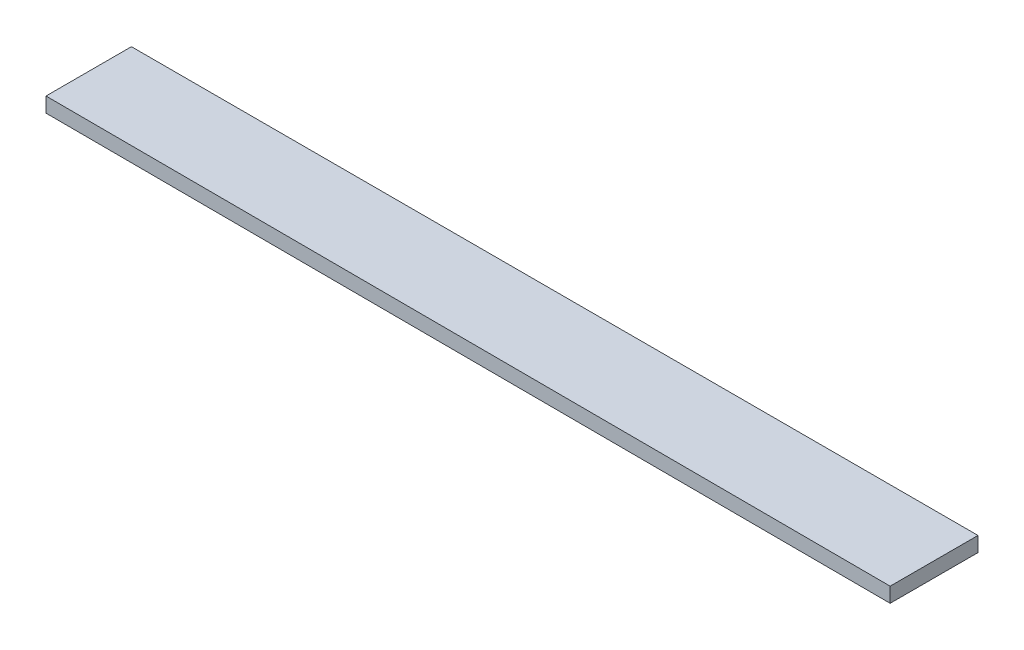
ISO-10303-21;
HEADER;
FILE_DESCRIPTION(('STEP AP214'),'2;1');
FILE_NAME('part.step','',(''),(''),'','','');
FILE_SCHEMA(('AUTOMOTIVE_DESIGN { 1 0 10303 214 1 1 1 1 }'));
ENDSEC;
DATA;
#1=APPLICATION_CONTEXT('core data for automotive mechanical design processes');
#2=APPLICATION_PROTOCOL_DEFINITION('international standard','automotive_design',2000,#1);
#3=PRODUCT_CONTEXT('',#1,'mechanical');
#4=PRODUCT('Part','Part','',(#3));
#5=PRODUCT_RELATED_PRODUCT_CATEGORY('part','',(#4));
#6=PRODUCT_DEFINITION_FORMATION('','',#4);
#7=PRODUCT_DEFINITION_CONTEXT('part definition',#1,'design');
#8=PRODUCT_DEFINITION('design','',#6,#7);
#9=PRODUCT_DEFINITION_SHAPE('','',#8);
#10=(LENGTH_UNIT() NAMED_UNIT(*) SI_UNIT(.MILLI.,.METRE.));
#11=(NAMED_UNIT(*) PLANE_ANGLE_UNIT() SI_UNIT($,.RADIAN.));
#12=(NAMED_UNIT(*) SI_UNIT($,.STERADIAN.) SOLID_ANGLE_UNIT());
#13=UNCERTAINTY_MEASURE_WITH_UNIT(LENGTH_MEASURE(1.E-05),#10,'distance_accuracy_value','');
#14=(GEOMETRIC_REPRESENTATION_CONTEXT(3) GLOBAL_UNCERTAINTY_ASSIGNED_CONTEXT((#13)) GLOBAL_UNIT_ASSIGNED_CONTEXT((#10,
#11,#12)) REPRESENTATION_CONTEXT('',''));
#15=CARTESIAN_POINT('',(0.,0.,0.));
#16=DIRECTION('',(0.,0.,1.));
#17=DIRECTION('',(1.,0.,0.));
#18=AXIS2_PLACEMENT_3D('',#15,#16,#17);
#19=CARTESIAN_POINT('',(0.,2.,0.));
#20=DIRECTION('',(0.00286274438782817,0.,-0.99999590233889));
#21=DIRECTION('',(-0.99999590233889,0.,-0.00286274438782817));
#22=AXIS2_PLACEMENT_3D('',#19,#20,#21);
#23=PLANE('',#22);
#24=DIRECTION('',(0.99999590233889,0.,0.00286274438782817));
#25=VECTOR('',#24,1.);
#26=CARTESIAN_POINT('',(0.,0.,0.));
#27=LINE('',#26,#25);
#28=CARTESIAN_POINT('',(0.,0.,0.));
#29=VERTEX_POINT('',#28);
#30=CARTESIAN_POINT('',(113.83622067277,0.,0.325885337230214));
#31=VERTEX_POINT('',#30);
#32=EDGE_CURVE('E107',#29,#31,#27,.T.);
#33=ORIENTED_EDGE('',*,*,#32,.T.);
#34=DIRECTION('',(0.,-1.,0.));
#35=VECTOR('',#34,1.);
#36=CARTESIAN_POINT('',(113.83622067277,2.,0.325885337230214));
#37=LINE('',#36,#35);
#38=CARTESIAN_POINT('',(113.83622067277,2.,0.325885337230214));
#39=VERTEX_POINT('',#38);
#40=EDGE_CURVE('E11',#39,#31,#37,.T.);
#41=ORIENTED_EDGE('',*,*,#40,.F.);
#42=DIRECTION('',(0.99999590233889,0.,0.00286274438782817));
#43=VECTOR('',#42,1.);
#44=CARTESIAN_POINT('',(0.,2.,0.));
#45=LINE('',#44,#43);
#46=CARTESIAN_POINT('',(0.,2.,0.));
#47=VERTEX_POINT('',#46);
#48=EDGE_CURVE('E91',#47,#39,#45,.T.);
#49=ORIENTED_EDGE('',*,*,#48,.F.);
#50=DIRECTION('',(0.,-1.,0.));
#51=VECTOR('',#50,1.);
#52=CARTESIAN_POINT('',(0.,2.,0.));
#53=LINE('',#52,#51);
#54=EDGE_CURVE('E103',#47,#29,#53,.T.);
#55=ORIENTED_EDGE('',*,*,#54,.T.);
#56=EDGE_LOOP('',(#33,#41,#49,#55));
#57=FACE_BOUND('',#56,.T.);
#58=ADVANCED_FACE('F39',(#57),#23,.F.);
#59=CARTESIAN_POINT('',(113.83622067277,2.,0.325885337230214));
#60=DIRECTION('',(-1.,0.,0.));
#61=DIRECTION('',(0.,0.,1.));
#62=AXIS2_PLACEMENT_3D('',#59,#60,#61);
#63=PLANE('',#62);
#64=DIRECTION('',(0.,0.,-1.));
#65=VECTOR('',#64,1.);
#66=CARTESIAN_POINT('',(113.83622067277,0.,0.325885337230214));
#67=LINE('',#66,#65);
#68=CARTESIAN_POINT('',(113.83622067277,0.,-11.4880548610417));
#69=VERTEX_POINT('',#68);
#70=EDGE_CURVE('E96',#31,#69,#67,.T.);
#71=ORIENTED_EDGE('',*,*,#70,.T.);
#72=DIRECTION('',(0.,-1.,0.));
#73=VECTOR('',#72,1.);
#74=CARTESIAN_POINT('',(113.83622067277,2.,-11.4880548610417));
#75=LINE('',#74,#73);
#76=CARTESIAN_POINT('',(113.83622067277,2.,-11.4880548610417));
#77=VERTEX_POINT('',#76);
#78=EDGE_CURVE('E48',#77,#69,#75,.T.);
#79=ORIENTED_EDGE('',*,*,#78,.F.);
#80=DIRECTION('',(0.,0.,-1.));
#81=VECTOR('',#80,1.);
#82=CARTESIAN_POINT('',(113.83622067277,2.,0.325885337230214));
#83=LINE('',#82,#81);
#84=EDGE_CURVE('E86',#39,#77,#83,.T.);
#85=ORIENTED_EDGE('',*,*,#84,.F.);
#86=ORIENTED_EDGE('',*,*,#40,.T.);
#87=EDGE_LOOP('',(#71,#79,#85,#86));
#88=FACE_BOUND('',#87,.T.);
#89=ADVANCED_FACE('F95',(#88),#63,.F.);
#90=CARTESIAN_POINT('',(113.83622067277,2.,-11.4880548610417));
#91=DIRECTION('',(0.,0.,1.));
#92=DIRECTION('',(1.,0.,0.));
#93=AXIS2_PLACEMENT_3D('',#90,#91,#92);
#94=PLANE('',#93);
#95=DIRECTION('',(-1.,0.,0.));
#96=VECTOR('',#95,1.);
#97=CARTESIAN_POINT('',(113.83622067277,0.,-11.4880548610417));
#98=LINE('',#97,#96);
#99=CARTESIAN_POINT('',(0.,0.,-11.4880548610417));
#100=VERTEX_POINT('',#99);
#101=EDGE_CURVE('E73',#69,#100,#98,.T.);
#102=ORIENTED_EDGE('',*,*,#101,.T.);
#103=DIRECTION('',(0.,-1.,0.));
#104=VECTOR('',#103,1.);
#105=CARTESIAN_POINT('',(0.,2.,-11.4880548610417));
#106=LINE('',#105,#104);
#107=CARTESIAN_POINT('',(0.,2.,-11.4880548610417));
#108=VERTEX_POINT('',#107);
#109=EDGE_CURVE('E98',#108,#100,#106,.T.);
#110=ORIENTED_EDGE('',*,*,#109,.F.);
#111=DIRECTION('',(-1.,0.,0.));
#112=VECTOR('',#111,1.);
#113=CARTESIAN_POINT('',(113.83622067277,2.,-11.4880548610417));
#114=LINE('',#113,#112);
#115=EDGE_CURVE('E89',#77,#108,#114,.T.);
#116=ORIENTED_EDGE('',*,*,#115,.F.);
#117=ORIENTED_EDGE('',*,*,#78,.T.);
#118=EDGE_LOOP('',(#102,#110,#116,#117));
#119=FACE_BOUND('',#118,.T.);
#120=ADVANCED_FACE('F99',(#119),#94,.F.);
#121=CARTESIAN_POINT('',(0.,2.,-11.4880548610417));
#122=DIRECTION('',(1.,0.,0.));
#123=DIRECTION('',(0.,0.,-1.));
#124=AXIS2_PLACEMENT_3D('',#121,#122,#123);
#125=PLANE('',#124);
#126=DIRECTION('',(0.,0.,1.));
#127=VECTOR('',#126,1.);
#128=CARTESIAN_POINT('',(0.,0.,-11.4880548610417));
#129=LINE('',#128,#127);
#130=EDGE_CURVE('E79',#100,#29,#129,.T.);
#131=ORIENTED_EDGE('',*,*,#130,.T.);
#132=ORIENTED_EDGE('',*,*,#54,.F.);
#133=DIRECTION('',(0.,0.,1.));
#134=VECTOR('',#133,1.);
#135=CARTESIAN_POINT('',(0.,2.,-11.4880548610417));
#136=LINE('',#135,#134);
#137=EDGE_CURVE('E56',#108,#47,#136,.T.);
#138=ORIENTED_EDGE('',*,*,#137,.F.);
#139=ORIENTED_EDGE('',*,*,#109,.T.);
#140=EDGE_LOOP('',(#131,#132,#138,#139));
#141=FACE_BOUND('',#140,.T.);
#142=ADVANCED_FACE('F120',(#141),#125,.F.);
#143=CARTESIAN_POINT('',(0.,2.,0.));
#144=DIRECTION('',(0.,1.,0.));
#145=DIRECTION('',(0.,0.,1.));
#146=AXIS2_PLACEMENT_3D('',#143,#144,#145);
#147=PLANE('',#146);
#148=ORIENTED_EDGE('',*,*,#48,.T.);
#149=ORIENTED_EDGE('',*,*,#84,.T.);
#150=ORIENTED_EDGE('',*,*,#115,.T.);
#151=ORIENTED_EDGE('',*,*,#137,.T.);
#152=EDGE_LOOP('',(#148,#149,#150,#151));
#153=FACE_BOUND('',#152,.T.);
#154=ADVANCED_FACE('F87',(#153),#147,.T.);
#155=CARTESIAN_POINT('',(0.,0.,0.));
#156=DIRECTION('',(0.,1.,0.));
#157=DIRECTION('',(0.,0.,1.));
#158=AXIS2_PLACEMENT_3D('',#155,#156,#157);
#159=PLANE('',#158);
#160=ORIENTED_EDGE('',*,*,#32,.F.);
#161=ORIENTED_EDGE('',*,*,#130,.F.);
#162=ORIENTED_EDGE('',*,*,#101,.F.);
#163=ORIENTED_EDGE('',*,*,#70,.F.);
#164=EDGE_LOOP('',(#160,#161,#162,#163));
#165=FACE_BOUND('',#164,.T.);
#166=ADVANCED_FACE('F123',(#165),#159,.F.);
#167=CLOSED_SHELL('',(#58,#89,#120,#142,#154,#166));
#168=MANIFOLD_SOLID_BREP('B2',#167);
#169=ADVANCED_BREP_SHAPE_REPRESENTATION('',(#18,#168),#14);
#170=SHAPE_DEFINITION_REPRESENTATION(#9,#169);
ENDSEC;
END-ISO-10303-21;
